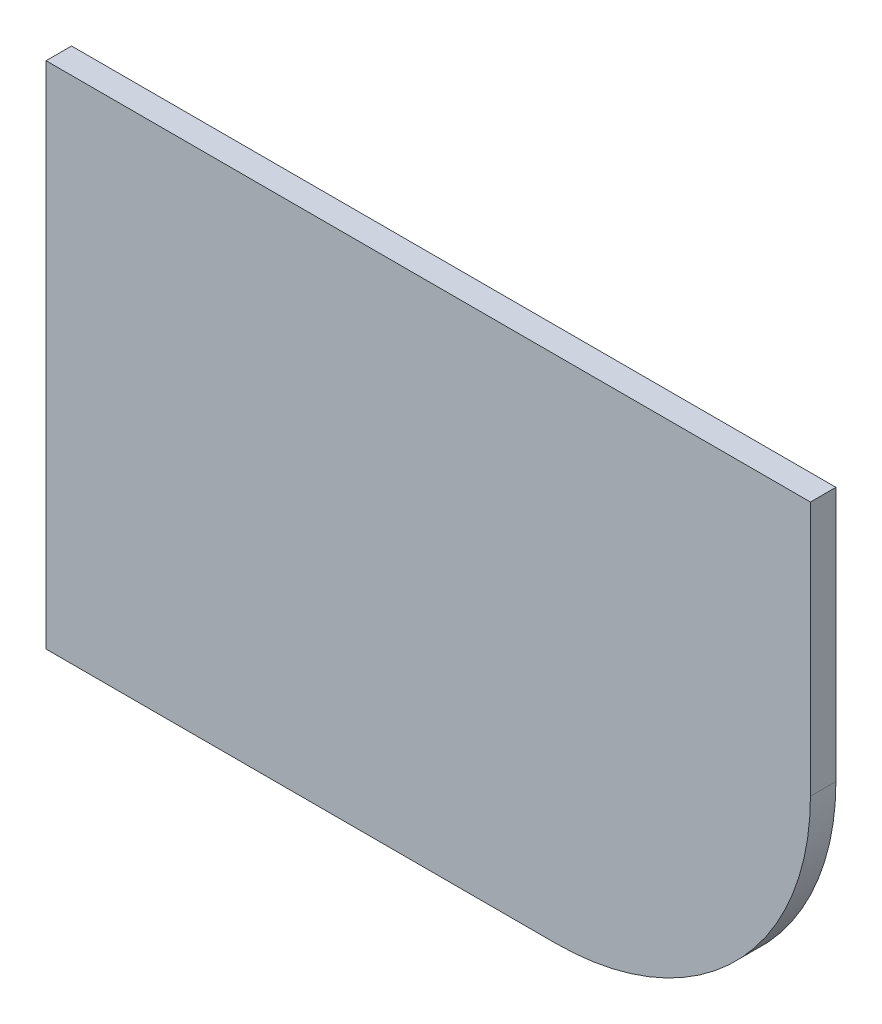
ISO-10303-21;
HEADER;
FILE_DESCRIPTION(('STEP AP214'),'2;1');
FILE_NAME('part.step','',(''),(''),'','','');
FILE_SCHEMA(('AUTOMOTIVE_DESIGN { 1 0 10303 214 1 1 1 1 }'));
ENDSEC;
DATA;
#1=APPLICATION_CONTEXT('core data for automotive mechanical design processes');
#2=APPLICATION_PROTOCOL_DEFINITION('international standard','automotive_design',2000,#1);
#3=PRODUCT_CONTEXT('',#1,'mechanical');
#4=PRODUCT('Part','Part','',(#3));
#5=PRODUCT_RELATED_PRODUCT_CATEGORY('part','',(#4));
#6=PRODUCT_DEFINITION_FORMATION('','',#4);
#7=PRODUCT_DEFINITION_CONTEXT('part definition',#1,'design');
#8=PRODUCT_DEFINITION('design','',#6,#7);
#9=PRODUCT_DEFINITION_SHAPE('','',#8);
#10=(LENGTH_UNIT() NAMED_UNIT(*) SI_UNIT(.MILLI.,.METRE.));
#11=(NAMED_UNIT(*) PLANE_ANGLE_UNIT() SI_UNIT($,.RADIAN.));
#12=(NAMED_UNIT(*) SI_UNIT($,.STERADIAN.) SOLID_ANGLE_UNIT());
#13=UNCERTAINTY_MEASURE_WITH_UNIT(LENGTH_MEASURE(1.E-05),#10,'distance_accuracy_value','');
#14=(GEOMETRIC_REPRESENTATION_CONTEXT(3) GLOBAL_UNCERTAINTY_ASSIGNED_CONTEXT((#13)) GLOBAL_UNIT_ASSIGNED_CONTEXT((#10,
#11,#12)) REPRESENTATION_CONTEXT('',''));
#15=CARTESIAN_POINT('',(0.,0.,0.));
#16=DIRECTION('',(0.,0.,1.));
#17=DIRECTION('',(1.,0.,0.));
#18=AXIS2_PLACEMENT_3D('',#15,#16,#17);
#19=CARTESIAN_POINT('',(0.,200.,5.));
#20=DIRECTION('',(0.,-1.,0.));
#21=DIRECTION('',(0.,0.,-1.));
#22=AXIS2_PLACEMENT_3D('',#19,#20,#21);
#23=PLANE('',#22);
#24=DIRECTION('',(-1.,0.,0.));
#25=VECTOR('',#24,1.);
#26=CARTESIAN_POINT('',(0.,200.,-5.));
#27=LINE('',#26,#25);
#28=CARTESIAN_POINT('',(300.,200.,-5.));
#29=VERTEX_POINT('',#28);
#30=CARTESIAN_POINT('',(0.,200.,-5.));
#31=VERTEX_POINT('',#30);
#32=EDGE_CURVE('E114',#29,#31,#27,.T.);
#33=ORIENTED_EDGE('',*,*,#32,.T.);
#34=DIRECTION('',(0.,0.,-1.));
#35=VECTOR('',#34,1.);
#36=CARTESIAN_POINT('',(0.,200.,5.));
#37=LINE('',#36,#35);
#38=CARTESIAN_POINT('',(0.,200.,5.));
#39=VERTEX_POINT('',#38);
#40=EDGE_CURVE('E11',#39,#31,#37,.T.);
#41=ORIENTED_EDGE('',*,*,#40,.F.);
#42=DIRECTION('',(-1.,0.,0.));
#43=VECTOR('',#42,1.);
#44=CARTESIAN_POINT('',(0.,200.,5.));
#45=LINE('',#44,#43);
#46=CARTESIAN_POINT('',(300.,200.,5.));
#47=VERTEX_POINT('',#46);
#48=EDGE_CURVE('E123',#47,#39,#45,.T.);
#49=ORIENTED_EDGE('',*,*,#48,.F.);
#50=DIRECTION('',(0.,0.,-1.));
#51=VECTOR('',#50,1.);
#52=CARTESIAN_POINT('',(300.,200.,5.));
#53=LINE('',#52,#51);
#54=EDGE_CURVE('E110',#47,#29,#53,.T.);
#55=ORIENTED_EDGE('',*,*,#54,.T.);
#56=EDGE_LOOP('',(#33,#41,#49,#55));
#57=FACE_BOUND('',#56,.T.);
#58=ADVANCED_FACE('F40',(#57),#23,.F.);
#59=CARTESIAN_POINT('',(0.,200.,5.));
#60=DIRECTION('',(1.,0.,0.));
#61=DIRECTION('',(0.,1.,0.));
#62=AXIS2_PLACEMENT_3D('',#59,#60,#61);
#63=PLANE('',#62);
#64=DIRECTION('',(0.,-1.,0.));
#65=VECTOR('',#64,1.);
#66=CARTESIAN_POINT('',(0.,200.,-5.));
#67=LINE('',#66,#65);
#68=CARTESIAN_POINT('',(0.,0.,-5.));
#69=VERTEX_POINT('',#68);
#70=EDGE_CURVE('E117',#31,#69,#67,.T.);
#71=ORIENTED_EDGE('',*,*,#70,.T.);
#72=DIRECTION('',(0.,0.,-1.));
#73=VECTOR('',#72,1.);
#74=CARTESIAN_POINT('',(0.,0.,5.));
#75=LINE('',#74,#73);
#76=CARTESIAN_POINT('',(0.,0.,5.));
#77=VERTEX_POINT('',#76);
#78=EDGE_CURVE('E48',#77,#69,#75,.T.);
#79=ORIENTED_EDGE('',*,*,#78,.F.);
#80=DIRECTION('',(0.,-1.,0.));
#81=VECTOR('',#80,1.);
#82=CARTESIAN_POINT('',(0.,200.,5.));
#83=LINE('',#82,#81);
#84=EDGE_CURVE('E90',#39,#77,#83,.T.);
#85=ORIENTED_EDGE('',*,*,#84,.F.);
#86=ORIENTED_EDGE('',*,*,#40,.T.);
#87=EDGE_LOOP('',(#71,#79,#85,#86));
#88=FACE_BOUND('',#87,.T.);
#89=ADVANCED_FACE('F142',(#88),#63,.F.);
#90=CARTESIAN_POINT('',(200.,0.,5.));
#91=DIRECTION('',(0.,1.,0.));
#92=DIRECTION('',(-1.,0.,0.));
#93=AXIS2_PLACEMENT_3D('',#90,#91,#92);
#94=PLANE('',#93);
#95=DIRECTION('',(1.,0.,0.));
#96=VECTOR('',#95,1.);
#97=CARTESIAN_POINT('',(200.,0.,-5.));
#98=LINE('',#97,#96);
#99=CARTESIAN_POINT('',(200.,0.,-5.));
#100=VERTEX_POINT('',#99);
#101=EDGE_CURVE('E105',#69,#100,#98,.T.);
#102=ORIENTED_EDGE('',*,*,#101,.T.);
#103=DIRECTION('',(0.,0.,-1.));
#104=VECTOR('',#103,1.);
#105=CARTESIAN_POINT('',(200.,0.,5.));
#106=LINE('',#105,#104);
#107=CARTESIAN_POINT('',(200.,0.,5.));
#108=VERTEX_POINT('',#107);
#109=EDGE_CURVE('E102',#108,#100,#106,.T.);
#110=ORIENTED_EDGE('',*,*,#109,.F.);
#111=DIRECTION('',(1.,0.,0.));
#112=VECTOR('',#111,1.);
#113=CARTESIAN_POINT('',(200.,0.,5.));
#114=LINE('',#113,#112);
#115=EDGE_CURVE('E94',#77,#108,#114,.T.);
#116=ORIENTED_EDGE('',*,*,#115,.F.);
#117=ORIENTED_EDGE('',*,*,#78,.T.);
#118=EDGE_LOOP('',(#102,#110,#116,#117));
#119=FACE_BOUND('',#118,.T.);
#120=ADVANCED_FACE('F103',(#119),#94,.F.);
#121=CARTESIAN_POINT('',(200.,100.,5.));
#122=DIRECTION('',(0.,0.,-1.));
#123=DIRECTION('',(-1.,0.,0.));
#124=AXIS2_PLACEMENT_3D('',#121,#122,#123);
#125=CYLINDRICAL_SURFACE('',#124,100.);
#126=CARTESIAN_POINT('',(200.,100.,-5.));
#127=DIRECTION('',(0.,0.,1.));
#128=DIRECTION('',(-1.,0.,0.));
#129=AXIS2_PLACEMENT_3D('',#126,#127,#128);
#130=CIRCLE('',#129,100.);
#131=CARTESIAN_POINT('',(300.,100.,-5.));
#132=VERTEX_POINT('',#131);
#133=EDGE_CURVE('E76',#100,#132,#130,.T.);
#134=ORIENTED_EDGE('',*,*,#133,.T.);
#135=DIRECTION('',(0.,0.,-1.));
#136=VECTOR('',#135,1.);
#137=CARTESIAN_POINT('',(300.,100.,5.));
#138=LINE('',#137,#136);
#139=CARTESIAN_POINT('',(300.,100.,5.));
#140=VERTEX_POINT('',#139);
#141=EDGE_CURVE('E106',#140,#132,#138,.T.);
#142=ORIENTED_EDGE('',*,*,#141,.F.);
#143=CARTESIAN_POINT('',(200.,100.,5.));
#144=DIRECTION('',(0.,0.,1.));
#145=DIRECTION('',(-1.,0.,0.));
#146=AXIS2_PLACEMENT_3D('',#143,#144,#145);
#147=CIRCLE('',#146,100.);
#148=EDGE_CURVE('E98',#108,#140,#147,.T.);
#149=ORIENTED_EDGE('',*,*,#148,.F.);
#150=ORIENTED_EDGE('',*,*,#109,.T.);
#151=EDGE_LOOP('',(#134,#142,#149,#150));
#152=FACE_BOUND('',#151,.T.);
#153=ADVANCED_FACE('F108',(#152),#125,.T.);
#154=CARTESIAN_POINT('',(300.,200.,5.));
#155=DIRECTION('',(-1.,0.,0.));
#156=DIRECTION('',(0.,-1.,0.));
#157=AXIS2_PLACEMENT_3D('',#154,#155,#156);
#158=PLANE('',#157);
#159=DIRECTION('',(0.,1.,0.));
#160=VECTOR('',#159,1.);
#161=CARTESIAN_POINT('',(300.,200.,-5.));
#162=LINE('',#161,#160);
#163=EDGE_CURVE('E82',#132,#29,#162,.T.);
#164=ORIENTED_EDGE('',*,*,#163,.T.);
#165=ORIENTED_EDGE('',*,*,#54,.F.);
#166=DIRECTION('',(0.,1.,0.));
#167=VECTOR('',#166,1.);
#168=CARTESIAN_POINT('',(300.,200.,5.));
#169=LINE('',#168,#167);
#170=EDGE_CURVE('E56',#140,#47,#169,.T.);
#171=ORIENTED_EDGE('',*,*,#170,.F.);
#172=ORIENTED_EDGE('',*,*,#141,.T.);
#173=EDGE_LOOP('',(#164,#165,#171,#172));
#174=FACE_BOUND('',#173,.T.);
#175=ADVANCED_FACE('F131',(#174),#158,.F.);
#176=CARTESIAN_POINT('',(200.,100.,5.));
#177=DIRECTION('',(0.,0.,-1.));
#178=DIRECTION('',(-1.,0.,0.));
#179=AXIS2_PLACEMENT_3D('',#176,#177,#178);
#180=PLANE('',#179);
#181=ORIENTED_EDGE('',*,*,#48,.T.);
#182=ORIENTED_EDGE('',*,*,#84,.T.);
#183=ORIENTED_EDGE('',*,*,#115,.T.);
#184=ORIENTED_EDGE('',*,*,#148,.T.);
#185=ORIENTED_EDGE('',*,*,#170,.T.);
#186=EDGE_LOOP('',(#181,#182,#183,#184,#185));
#187=FACE_BOUND('',#186,.T.);
#188=ADVANCED_FACE('F96',(#187),#180,.F.);
#189=CARTESIAN_POINT('',(200.,100.,-5.));
#190=DIRECTION('',(0.,0.,-1.));
#191=DIRECTION('',(-1.,0.,0.));
#192=AXIS2_PLACEMENT_3D('',#189,#190,#191);
#193=PLANE('',#192);
#194=CARTESIAN_POINT('',(225.,140.,-5.));
#195=DIRECTION('',(0.,0.,-1.));
#196=DIRECTION('',(-1.,0.,0.));
#197=AXIS2_PLACEMENT_3D('',#194,#195,#196);
#198=CIRCLE('',#197,2.5);
#199=CARTESIAN_POINT('',(222.5,140.,-5.));
#200=VERTEX_POINT('',#199);
#201=EDGE_CURVE('E300',#200,#200,#198,.T.);
#202=ORIENTED_EDGE('',*,*,#201,.F.);
#203=EDGE_LOOP('',(#202));
#204=FACE_BOUND('',#203,.T.);
#205=CARTESIAN_POINT('',(150.,90.,-5.));
#206=DIRECTION('',(0.,0.,-1.));
#207=DIRECTION('',(-1.,0.,0.));
#208=AXIS2_PLACEMENT_3D('',#205,#206,#207);
#209=CIRCLE('',#208,2.5);
#210=CARTESIAN_POINT('',(147.5,90.,-5.));
#211=VERTEX_POINT('',#210);
#212=EDGE_CURVE('E303',#211,#211,#209,.T.);
#213=ORIENTED_EDGE('',*,*,#212,.F.);
#214=EDGE_LOOP('',(#213));
#215=FACE_BOUND('',#214,.T.);
#216=CARTESIAN_POINT('',(60.,140.,-5.));
#217=DIRECTION('',(0.,0.,-1.));
#218=DIRECTION('',(-1.,0.,0.));
#219=AXIS2_PLACEMENT_3D('',#216,#217,#218);
#220=CIRCLE('',#219,2.5);
#221=CARTESIAN_POINT('',(57.5,140.,-5.));
#222=VERTEX_POINT('',#221);
#223=EDGE_CURVE('E311',#222,#222,#220,.T.);
#224=ORIENTED_EDGE('',*,*,#223,.F.);
#225=EDGE_LOOP('',(#224));
#226=FACE_BOUND('',#225,.T.);
#227=CARTESIAN_POINT('',(75.,40.,-5.));
#228=DIRECTION('',(0.,0.,-1.));
#229=DIRECTION('',(-1.,0.,0.));
#230=AXIS2_PLACEMENT_3D('',#227,#228,#229);
#231=CIRCLE('',#230,2.5);
#232=CARTESIAN_POINT('',(72.5,40.,-5.));
#233=VERTEX_POINT('',#232);
#234=EDGE_CURVE('E317',#233,#233,#231,.T.);
#235=ORIENTED_EDGE('',*,*,#234,.F.);
#236=EDGE_LOOP('',(#235));
#237=FACE_BOUND('',#236,.T.);
#238=ORIENTED_EDGE('',*,*,#32,.F.);
#239=ORIENTED_EDGE('',*,*,#163,.F.);
#240=ORIENTED_EDGE('',*,*,#133,.F.);
#241=ORIENTED_EDGE('',*,*,#101,.F.);
#242=ORIENTED_EDGE('',*,*,#70,.F.);
#243=EDGE_LOOP('',(#238,#239,#240,#241,#242));
#244=FACE_BOUND('',#243,.T.);
#245=ADVANCED_FACE('F127',(#204,#215,#226,#237,#244),#193,.T.);
#246=CARTESIAN_POINT('',(75.,40.,0.));
#247=DIRECTION('',(0.,0.,-1.));
#248=DIRECTION('',(-1.,0.,0.));
#249=AXIS2_PLACEMENT_3D('',#246,#247,#248);
#250=CYLINDRICAL_SURFACE('',#249,2.5);
#251=CARTESIAN_POINT('',(75.,40.,0.));
#252=DIRECTION('',(0.,0.,-1.));
#253=DIRECTION('',(-1.,0.,0.));
#254=AXIS2_PLACEMENT_3D('',#251,#252,#253);
#255=CIRCLE('',#254,2.5);
#256=CARTESIAN_POINT('',(72.5,40.,0.));
#257=VERTEX_POINT('',#256);
#258=EDGE_CURVE('E320',#257,#257,#255,.T.);
#259=ORIENTED_EDGE('',*,*,#258,.F.);
#260=EDGE_LOOP('',(#259));
#261=FACE_BOUND('',#260,.T.);
#262=ORIENTED_EDGE('',*,*,#234,.T.);
#263=EDGE_LOOP('',(#262));
#264=FACE_BOUND('',#263,.T.);
#265=ADVANCED_FACE('F178',(#261,#264),#250,.F.);
#266=CARTESIAN_POINT('',(75.,40.,0.));
#267=DIRECTION('',(0.,0.,-1.));
#268=DIRECTION('',(-1.,0.,0.));
#269=AXIS2_PLACEMENT_3D('',#266,#267,#268);
#270=PLANE('',#269);
#271=ORIENTED_EDGE('',*,*,#258,.T.);
#272=EDGE_LOOP('',(#271));
#273=FACE_BOUND('',#272,.T.);
#274=ADVANCED_FACE('F188',(#273),#270,.T.);
#275=CARTESIAN_POINT('',(60.,140.,0.));
#276=DIRECTION('',(0.,0.,-1.));
#277=DIRECTION('',(-1.,0.,0.));
#278=AXIS2_PLACEMENT_3D('',#275,#276,#277);
#279=CYLINDRICAL_SURFACE('',#278,2.5);
#280=CARTESIAN_POINT('',(60.,140.,0.));
#281=DIRECTION('',(0.,0.,-1.));
#282=DIRECTION('',(-1.,0.,0.));
#283=AXIS2_PLACEMENT_3D('',#280,#281,#282);
#284=CIRCLE('',#283,2.5);
#285=CARTESIAN_POINT('',(57.5,140.,0.));
#286=VERTEX_POINT('',#285);
#287=EDGE_CURVE('E314',#286,#286,#284,.T.);
#288=ORIENTED_EDGE('',*,*,#287,.F.);
#289=EDGE_LOOP('',(#288));
#290=FACE_BOUND('',#289,.T.);
#291=ORIENTED_EDGE('',*,*,#223,.T.);
#292=EDGE_LOOP('',(#291));
#293=FACE_BOUND('',#292,.T.);
#294=ADVANCED_FACE('F199',(#290,#293),#279,.F.);
#295=CARTESIAN_POINT('',(60.,140.,0.));
#296=DIRECTION('',(0.,0.,-1.));
#297=DIRECTION('',(-1.,0.,0.));
#298=AXIS2_PLACEMENT_3D('',#295,#296,#297);
#299=PLANE('',#298);
#300=ORIENTED_EDGE('',*,*,#287,.T.);
#301=EDGE_LOOP('',(#300));
#302=FACE_BOUND('',#301,.T.);
#303=ADVANCED_FACE('F210',(#302),#299,.T.);
#304=CARTESIAN_POINT('',(150.,90.,0.));
#305=DIRECTION('',(0.,0.,-1.));
#306=DIRECTION('',(-1.,0.,0.));
#307=AXIS2_PLACEMENT_3D('',#304,#305,#306);
#308=CYLINDRICAL_SURFACE('',#307,2.5);
#309=CARTESIAN_POINT('',(150.,90.,0.));
#310=DIRECTION('',(0.,0.,-1.));
#311=DIRECTION('',(-1.,0.,0.));
#312=AXIS2_PLACEMENT_3D('',#309,#310,#311);
#313=CIRCLE('',#312,2.5);
#314=CARTESIAN_POINT('',(147.5,90.,0.));
#315=VERTEX_POINT('',#314);
#316=EDGE_CURVE('E308',#315,#315,#313,.T.);
#317=ORIENTED_EDGE('',*,*,#316,.F.);
#318=EDGE_LOOP('',(#317));
#319=FACE_BOUND('',#318,.T.);
#320=ORIENTED_EDGE('',*,*,#212,.T.);
#321=EDGE_LOOP('',(#320));
#322=FACE_BOUND('',#321,.T.);
#323=ADVANCED_FACE('F221',(#319,#322),#308,.F.);
#324=CARTESIAN_POINT('',(150.,90.,0.));
#325=DIRECTION('',(0.,0.,-1.));
#326=DIRECTION('',(-1.,0.,0.));
#327=AXIS2_PLACEMENT_3D('',#324,#325,#326);
#328=PLANE('',#327);
#329=ORIENTED_EDGE('',*,*,#316,.T.);
#330=EDGE_LOOP('',(#329));
#331=FACE_BOUND('',#330,.T.);
#332=ADVANCED_FACE('F232',(#331),#328,.T.);
#333=CARTESIAN_POINT('',(225.,140.,0.));
#334=DIRECTION('',(0.,0.,-1.));
#335=DIRECTION('',(-1.,0.,0.));
#336=AXIS2_PLACEMENT_3D('',#333,#334,#335);
#337=CYLINDRICAL_SURFACE('',#336,2.5);
#338=CARTESIAN_POINT('',(225.,140.,0.));
#339=DIRECTION('',(0.,0.,-1.));
#340=DIRECTION('',(-1.,0.,0.));
#341=AXIS2_PLACEMENT_3D('',#338,#339,#340);
#342=CIRCLE('',#341,2.5);
#343=CARTESIAN_POINT('',(222.5,140.,0.));
#344=VERTEX_POINT('',#343);
#345=EDGE_CURVE('E118',#344,#344,#342,.T.);
#346=ORIENTED_EDGE('',*,*,#345,.F.);
#347=EDGE_LOOP('',(#346));
#348=FACE_BOUND('',#347,.T.);
#349=ORIENTED_EDGE('',*,*,#201,.T.);
#350=EDGE_LOOP('',(#349));
#351=FACE_BOUND('',#350,.T.);
#352=ADVANCED_FACE('F243',(#348,#351),#337,.F.);
#353=CARTESIAN_POINT('',(225.,140.,0.));
#354=DIRECTION('',(0.,0.,-1.));
#355=DIRECTION('',(-1.,0.,0.));
#356=AXIS2_PLACEMENT_3D('',#353,#354,#355);
#357=PLANE('',#356);
#358=ORIENTED_EDGE('',*,*,#345,.T.);
#359=EDGE_LOOP('',(#358));
#360=FACE_BOUND('',#359,.T.);
#361=ADVANCED_FACE('F254',(#360),#357,.T.);
#362=CLOSED_SHELL('',(#58,#89,#120,#153,#175,#188,#245,#265,#274,#294,#303,#323,#332,#352,#361));
#363=MANIFOLD_SOLID_BREP('B2',#362);
#364=ADVANCED_BREP_SHAPE_REPRESENTATION('',(#18,#363),#14);
#365=SHAPE_DEFINITION_REPRESENTATION(#9,#364);
ENDSEC;
END-ISO-10303-21;
